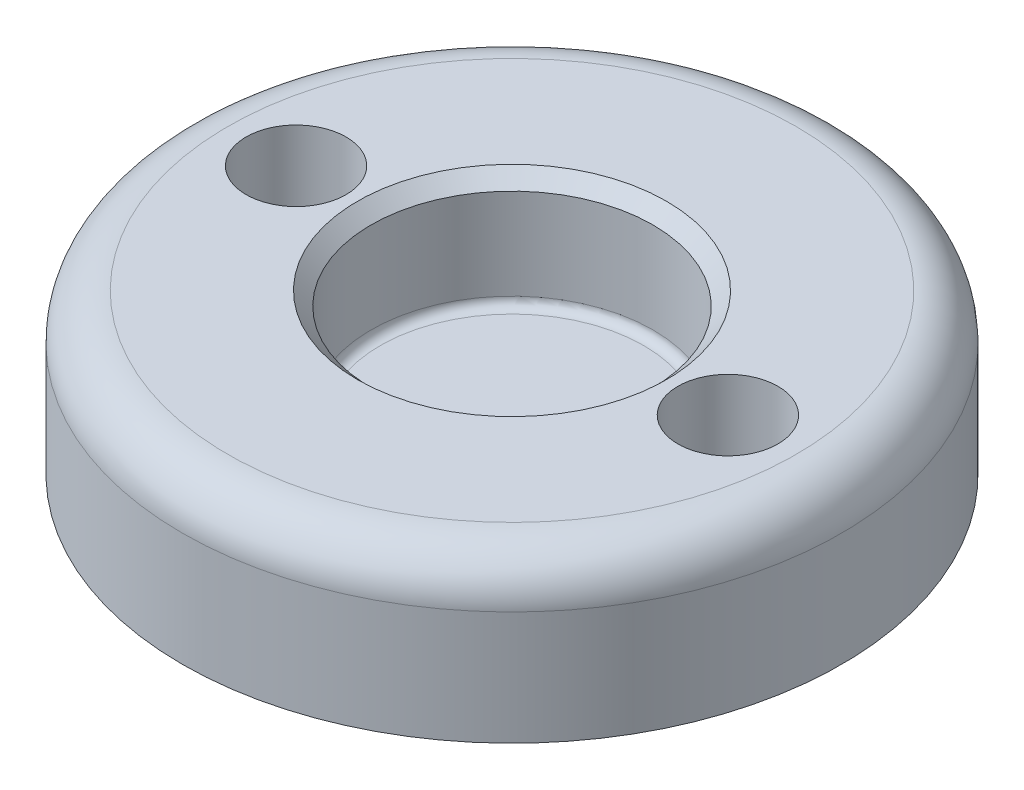
ISO-10303-21;
HEADER;
FILE_DESCRIPTION(('STEP AP214'),'2;1');
FILE_NAME('part.step','',(''),(''),'','','');
FILE_SCHEMA(('AUTOMOTIVE_DESIGN { 1 0 10303 214 1 1 1 1 }'));
ENDSEC;
DATA;
#1=APPLICATION_CONTEXT('core data for automotive mechanical design processes');
#2=APPLICATION_PROTOCOL_DEFINITION('international standard','automotive_design',2000,#1);
#3=PRODUCT_CONTEXT('',#1,'mechanical');
#4=PRODUCT('Part','Part','',(#3));
#5=PRODUCT_RELATED_PRODUCT_CATEGORY('part','',(#4));
#6=PRODUCT_DEFINITION_FORMATION('','',#4);
#7=PRODUCT_DEFINITION_CONTEXT('part definition',#1,'design');
#8=PRODUCT_DEFINITION('design','',#6,#7);
#9=PRODUCT_DEFINITION_SHAPE('','',#8);
#10=(LENGTH_UNIT() NAMED_UNIT(*) SI_UNIT(.MILLI.,.METRE.));
#11=(NAMED_UNIT(*) PLANE_ANGLE_UNIT() SI_UNIT($,.RADIAN.));
#12=(NAMED_UNIT(*) SI_UNIT($,.STERADIAN.) SOLID_ANGLE_UNIT());
#13=UNCERTAINTY_MEASURE_WITH_UNIT(LENGTH_MEASURE(1.E-05),#10,'distance_accuracy_value','');
#14=(GEOMETRIC_REPRESENTATION_CONTEXT(3) GLOBAL_UNCERTAINTY_ASSIGNED_CONTEXT((#13)) GLOBAL_UNIT_ASSIGNED_CONTEXT((#10,
#11,#12)) REPRESENTATION_CONTEXT('',''));
#15=CARTESIAN_POINT('',(0.,0.,0.));
#16=DIRECTION('',(0.,0.,1.));
#17=DIRECTION('',(1.,0.,0.));
#18=AXIS2_PLACEMENT_3D('',#15,#16,#17);
#19=CARTESIAN_POINT('',(0.,0.,0.));
#20=DIRECTION('',(0.,1.,0.));
#21=DIRECTION('',(0.,0.,1.));
#22=AXIS2_PLACEMENT_3D('',#19,#20,#21);
#23=PLANE('',#22);
#24=CARTESIAN_POINT('',(4.75,0.,0.));
#25=DIRECTION('',(0.,-1.,0.));
#26=DIRECTION('',(0.,0.,-1.));
#27=AXIS2_PLACEMENT_3D('',#24,#25,#26);
#28=CIRCLE('',#27,2.2);
#29=CARTESIAN_POINT('',(4.75,0.,-2.2));
#30=VERTEX_POINT('',#29);
#31=EDGE_CURVE('E95',#30,#30,#28,.T.);
#32=ORIENTED_EDGE('',*,*,#31,.F.);
#33=EDGE_LOOP('',(#32));
#34=FACE_BOUND('',#33,.T.);
#35=CARTESIAN_POINT('',(-4.75,0.,0.));
#36=DIRECTION('',(0.,-1.,0.));
#37=DIRECTION('',(0.,0.,-1.));
#38=AXIS2_PLACEMENT_3D('',#35,#36,#37);
#39=CIRCLE('',#38,2.2);
#40=CARTESIAN_POINT('',(-4.75,0.,-2.2));
#41=VERTEX_POINT('',#40);
#42=EDGE_CURVE('E68',#41,#41,#39,.T.);
#43=ORIENTED_EDGE('',*,*,#42,.F.);
#44=EDGE_LOOP('',(#43));
#45=FACE_BOUND('',#44,.T.);
#46=CARTESIAN_POINT('',(0.,0.,0.));
#47=DIRECTION('',(0.,-1.,0.));
#48=DIRECTION('',(0.,0.,-1.));
#49=AXIS2_PLACEMENT_3D('',#46,#47,#48);
#50=CIRCLE('',#49,7.25);
#51=CARTESIAN_POINT('',(0.,0.,-7.25));
#52=VERTEX_POINT('',#51);
#53=EDGE_CURVE('E74',#52,#52,#50,.T.);
#54=ORIENTED_EDGE('',*,*,#53,.T.);
#55=EDGE_LOOP('',(#54));
#56=FACE_BOUND('',#55,.T.);
#57=ADVANCED_FACE('F39',(#34,#45,#56),#23,.F.);
#58=CARTESIAN_POINT('',(0.,0.,0.));
#59=DIRECTION('',(0.,-1.,0.));
#60=DIRECTION('',(0.,0.,-1.));
#61=AXIS2_PLACEMENT_3D('',#58,#59,#60);
#62=CYLINDRICAL_SURFACE('',#61,7.25);
#63=CARTESIAN_POINT('',(0.,2.5,0.));
#64=DIRECTION('',(0.,-1.,0.));
#65=DIRECTION('',(0.,0.,-1.));
#66=AXIS2_PLACEMENT_3D('',#63,#64,#65);
#67=CIRCLE('',#66,7.25);
#68=CARTESIAN_POINT('',(0.,2.5,-7.25));
#69=VERTEX_POINT('',#68);
#70=EDGE_CURVE('E47',#69,#69,#67,.T.);
#71=ORIENTED_EDGE('',*,*,#70,.T.);
#72=EDGE_LOOP('',(#71));
#73=FACE_BOUND('',#72,.T.);
#74=ORIENTED_EDGE('',*,*,#53,.F.);
#75=EDGE_LOOP('',(#74));
#76=FACE_BOUND('',#75,.T.);
#77=ADVANCED_FACE('F104',(#73,#76),#62,.T.);
#78=CARTESIAN_POINT('',(-7.25,3.5,0.));
#79=DIRECTION('',(0.,-1.,0.));
#80=DIRECTION('',(0.,0.,-1.));
#81=AXIS2_PLACEMENT_3D('',#78,#79,#80);
#82=PLANE('',#81);
#83=CARTESIAN_POINT('',(0.,3.5,0.));
#84=DIRECTION('',(0.,-1.,0.));
#85=DIRECTION('',(0.,0.,-1.));
#86=AXIS2_PLACEMENT_3D('',#83,#84,#85);
#87=CIRCLE('',#86,6.25);
#88=CARTESIAN_POINT('',(0.,3.5,-6.25));
#89=VERTEX_POINT('',#88);
#90=EDGE_CURVE('E10',#89,#89,#87,.F.);
#91=ORIENTED_EDGE('',*,*,#90,.T.);
#92=EDGE_LOOP('',(#91));
#93=FACE_BOUND('',#92,.T.);
#94=CARTESIAN_POINT('',(4.75,3.5,0.));
#95=DIRECTION('',(0.,-1.,0.));
#96=DIRECTION('',(0.,0.,-1.));
#97=AXIS2_PLACEMENT_3D('',#94,#95,#96);
#98=CIRCLE('',#97,1.09999999999999);
#99=CARTESIAN_POINT('',(4.75,3.5,-1.09999999999999));
#100=VERTEX_POINT('',#99);
#101=EDGE_CURVE('E64',#100,#100,#98,.T.);
#102=ORIENTED_EDGE('',*,*,#101,.T.);
#103=EDGE_LOOP('',(#102));
#104=FACE_BOUND('',#103,.T.);
#105=CARTESIAN_POINT('',(-4.75,3.5,0.));
#106=DIRECTION('',(0.,-1.,0.));
#107=DIRECTION('',(0.,0.,-1.));
#108=AXIS2_PLACEMENT_3D('',#105,#106,#107);
#109=CIRCLE('',#108,1.09999999999999);
#110=CARTESIAN_POINT('',(-4.75,3.5,-1.09999999999999));
#111=VERTEX_POINT('',#110);
#112=EDGE_CURVE('E70',#111,#111,#109,.T.);
#113=ORIENTED_EDGE('',*,*,#112,.T.);
#114=EDGE_LOOP('',(#113));
#115=FACE_BOUND('',#114,.T.);
#116=CARTESIAN_POINT('',(0.,3.5,0.));
#117=DIRECTION('',(0.,-1.,0.));
#118=DIRECTION('',(0.,0.,-1.));
#119=AXIS2_PLACEMENT_3D('',#116,#117,#118);
#120=CIRCLE('',#119,3.4);
#121=CARTESIAN_POINT('',(0.,3.5,-3.4));
#122=VERTEX_POINT('',#121);
#123=EDGE_CURVE('E79',#122,#122,#120,.T.);
#124=ORIENTED_EDGE('',*,*,#123,.T.);
#125=EDGE_LOOP('',(#124));
#126=FACE_BOUND('',#125,.T.);
#127=ADVANCED_FACE('F111',(#93,#104,#115,#126),#82,.F.);
#128=CARTESIAN_POINT('',(0.,0.,0.));
#129=DIRECTION('',(0.,-1.,0.));
#130=DIRECTION('',(0.,0.,-1.));
#131=AXIS2_PLACEMENT_3D('',#128,#129,#130);
#132=CYLINDRICAL_SURFACE('',#131,3.1);
#133=CARTESIAN_POINT('',(0.,1.2,0.));
#134=DIRECTION('',(0.,-1.,0.));
#135=DIRECTION('',(0.,0.,-1.));
#136=AXIS2_PLACEMENT_3D('',#133,#134,#135);
#137=CIRCLE('',#136,3.1);
#138=CARTESIAN_POINT('',(0.,1.2,-3.1));
#139=VERTEX_POINT('',#138);
#140=EDGE_CURVE('E57',#139,#139,#137,.T.);
#141=ORIENTED_EDGE('',*,*,#140,.T.);
#142=EDGE_LOOP('',(#141));
#143=FACE_BOUND('',#142,.T.);
#144=CARTESIAN_POINT('',(0.,3.2,0.));
#145=DIRECTION('',(0.,-1.,0.));
#146=DIRECTION('',(0.,0.,-1.));
#147=AXIS2_PLACEMENT_3D('',#144,#145,#146);
#148=CIRCLE('',#147,3.1);
#149=CARTESIAN_POINT('',(0.,3.2,-3.1));
#150=VERTEX_POINT('',#149);
#151=EDGE_CURVE('E63',#150,#150,#148,.F.);
#152=ORIENTED_EDGE('',*,*,#151,.T.);
#153=EDGE_LOOP('',(#152));
#154=FACE_BOUND('',#153,.T.);
#155=ADVANCED_FACE('F116',(#143,#154),#132,.F.);
#156=CARTESIAN_POINT('',(-3.1,1.,0.));
#157=DIRECTION('',(0.,-1.,0.));
#158=DIRECTION('',(0.,0.,-1.));
#159=AXIS2_PLACEMENT_3D('',#156,#157,#158);
#160=PLANE('',#159);
#161=CARTESIAN_POINT('',(0.,1.,0.));
#162=DIRECTION('',(0.,-1.,0.));
#163=DIRECTION('',(0.,0.,-1.));
#164=AXIS2_PLACEMENT_3D('',#161,#162,#163);
#165=CIRCLE('',#164,2.9);
#166=CARTESIAN_POINT('',(0.,1.,-2.9));
#167=VERTEX_POINT('',#166);
#168=EDGE_CURVE('E52',#167,#167,#165,.F.);
#169=ORIENTED_EDGE('',*,*,#168,.T.);
#170=EDGE_LOOP('',(#169));
#171=FACE_BOUND('',#170,.T.);
#172=ADVANCED_FACE('F123',(#171),#160,.F.);
#173=CARTESIAN_POINT('',(0.,3.5,0.));
#174=DIRECTION('',(0.,1.,0.));
#175=DIRECTION('',(0.,0.,1.));
#176=AXIS2_PLACEMENT_3D('',#173,#174,#175);
#177=CONICAL_SURFACE('',#176,3.4,0.785398163397446);
#178=ORIENTED_EDGE('',*,*,#151,.F.);
#179=EDGE_LOOP('',(#178));
#180=FACE_BOUND('',#179,.T.);
#181=ORIENTED_EDGE('',*,*,#123,.F.);
#182=EDGE_LOOP('',(#181));
#183=FACE_BOUND('',#182,.T.);
#184=ADVANCED_FACE('F120',(#180,#183),#177,.F.);
#185=CARTESIAN_POINT('',(-4.75,0.,0.));
#186=DIRECTION('',(0.,-1.,0.));
#187=DIRECTION('',(0.,0.,-1.));
#188=AXIS2_PLACEMENT_3D('',#185,#186,#187);
#189=CYLINDRICAL_SURFACE('',#188,1.09999999999999);
#190=CARTESIAN_POINT('',(-4.75,1.1,0.));
#191=DIRECTION('',(0.,-1.,0.));
#192=DIRECTION('',(0.,0.,-1.));
#193=AXIS2_PLACEMENT_3D('',#190,#191,#192);
#194=CIRCLE('',#193,1.1);
#195=CARTESIAN_POINT('',(-4.75,1.1,-1.1));
#196=VERTEX_POINT('',#195);
#197=EDGE_CURVE('E75',#196,#196,#194,.T.);
#198=ORIENTED_EDGE('',*,*,#197,.T.);
#199=EDGE_LOOP('',(#198));
#200=FACE_BOUND('',#199,.T.);
#201=ORIENTED_EDGE('',*,*,#112,.F.);
#202=EDGE_LOOP('',(#201));
#203=FACE_BOUND('',#202,.T.);
#204=ADVANCED_FACE('F122',(#200,#203),#189,.F.);
#205=CARTESIAN_POINT('',(-4.75,0.,0.));
#206=DIRECTION('',(0.,-1.,0.));
#207=DIRECTION('',(0.,0.,-1.));
#208=AXIS2_PLACEMENT_3D('',#205,#206,#207);
#209=CONICAL_SURFACE('',#208,2.2,0.785398163397448);
#210=ORIENTED_EDGE('',*,*,#197,.F.);
#211=EDGE_LOOP('',(#210));
#212=FACE_BOUND('',#211,.T.);
#213=ORIENTED_EDGE('',*,*,#42,.T.);
#214=EDGE_LOOP('',(#213));
#215=FACE_BOUND('',#214,.T.);
#216=ADVANCED_FACE('F154',(#212,#215),#209,.F.);
#217=CARTESIAN_POINT('',(4.75,0.,0.));
#218=DIRECTION('',(0.,-1.,0.));
#219=DIRECTION('',(0.,0.,-1.));
#220=AXIS2_PLACEMENT_3D('',#217,#218,#219);
#221=CYLINDRICAL_SURFACE('',#220,1.09999999999999);
#222=CARTESIAN_POINT('',(4.75,1.1,0.));
#223=DIRECTION('',(0.,-1.,0.));
#224=DIRECTION('',(0.,0.,-1.));
#225=AXIS2_PLACEMENT_3D('',#222,#223,#224);
#226=CIRCLE('',#225,1.1);
#227=CARTESIAN_POINT('',(4.75,1.1,-1.1));
#228=VERTEX_POINT('',#227);
#229=EDGE_CURVE('E69',#228,#228,#226,.T.);
#230=ORIENTED_EDGE('',*,*,#229,.T.);
#231=EDGE_LOOP('',(#230));
#232=FACE_BOUND('',#231,.T.);
#233=ORIENTED_EDGE('',*,*,#101,.F.);
#234=EDGE_LOOP('',(#233));
#235=FACE_BOUND('',#234,.T.);
#236=ADVANCED_FACE('F133',(#232,#235),#221,.F.);
#237=CARTESIAN_POINT('',(4.75,0.,0.));
#238=DIRECTION('',(0.,-1.,0.));
#239=DIRECTION('',(0.,0.,-1.));
#240=AXIS2_PLACEMENT_3D('',#237,#238,#239);
#241=CONICAL_SURFACE('',#240,2.2,0.785398163397448);
#242=ORIENTED_EDGE('',*,*,#229,.F.);
#243=EDGE_LOOP('',(#242));
#244=FACE_BOUND('',#243,.T.);
#245=ORIENTED_EDGE('',*,*,#31,.T.);
#246=EDGE_LOOP('',(#245));
#247=FACE_BOUND('',#246,.T.);
#248=ADVANCED_FACE('F100',(#244,#247),#241,.F.);
#249=CARTESIAN_POINT('',(0.,1.2,0.));
#250=DIRECTION('',(0.,-1.,0.));
#251=DIRECTION('',(0.,0.,-1.));
#252=AXIS2_PLACEMENT_3D('',#249,#250,#251);
#253=TOROIDAL_SURFACE('',#252,2.9,0.2);
#254=ORIENTED_EDGE('',*,*,#168,.F.);
#255=EDGE_LOOP('',(#254));
#256=FACE_BOUND('',#255,.T.);
#257=ORIENTED_EDGE('',*,*,#140,.F.);
#258=EDGE_LOOP('',(#257));
#259=FACE_BOUND('',#258,.T.);
#260=ADVANCED_FACE('F125',(#256,#259),#253,.F.);
#261=CARTESIAN_POINT('',(0.,2.5,0.));
#262=DIRECTION('',(0.,-1.,0.));
#263=DIRECTION('',(0.,0.,-1.));
#264=AXIS2_PLACEMENT_3D('',#261,#262,#263);
#265=TOROIDAL_SURFACE('',#264,6.25,1.);
#266=ORIENTED_EDGE('',*,*,#90,.F.);
#267=EDGE_LOOP('',(#266));
#268=FACE_BOUND('',#267,.T.);
#269=ORIENTED_EDGE('',*,*,#70,.F.);
#270=EDGE_LOOP('',(#269));
#271=FACE_BOUND('',#270,.T.);
#272=ADVANCED_FACE('F41',(#268,#271),#265,.T.);
#273=CLOSED_SHELL('',(#57,#77,#127,#155,#172,#184,#204,#216,#236,#248,#260,#272));
#274=MANIFOLD_SOLID_BREP('B2',#273);
#275=ADVANCED_BREP_SHAPE_REPRESENTATION('',(#18,#274),#14);
#276=SHAPE_DEFINITION_REPRESENTATION(#9,#275);
ENDSEC;
END-ISO-10303-21;
